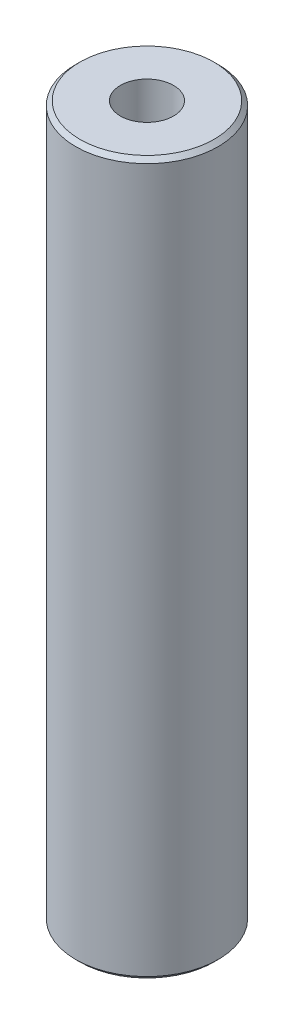
ISO-10303-21;
HEADER;
FILE_DESCRIPTION(('STEP AP214'),'2;1');
FILE_NAME('part.step','',(''),(''),'','','');
FILE_SCHEMA(('AUTOMOTIVE_DESIGN { 1 0 10303 214 1 1 1 1 }'));
ENDSEC;
DATA;
#1=APPLICATION_CONTEXT('core data for automotive mechanical design processes');
#2=APPLICATION_PROTOCOL_DEFINITION('international standard','automotive_design',2000,#1);
#3=PRODUCT_CONTEXT('',#1,'mechanical');
#4=PRODUCT('Part','Part','',(#3));
#5=PRODUCT_RELATED_PRODUCT_CATEGORY('part','',(#4));
#6=PRODUCT_DEFINITION_FORMATION('','',#4);
#7=PRODUCT_DEFINITION_CONTEXT('part definition',#1,'design');
#8=PRODUCT_DEFINITION('design','',#6,#7);
#9=PRODUCT_DEFINITION_SHAPE('','',#8);
#10=(LENGTH_UNIT() NAMED_UNIT(*) SI_UNIT(.MILLI.,.METRE.));
#11=(NAMED_UNIT(*) PLANE_ANGLE_UNIT() SI_UNIT($,.RADIAN.));
#12=(NAMED_UNIT(*) SI_UNIT($,.STERADIAN.) SOLID_ANGLE_UNIT());
#13=UNCERTAINTY_MEASURE_WITH_UNIT(LENGTH_MEASURE(1.E-05),#10,'distance_accuracy_value','');
#14=(GEOMETRIC_REPRESENTATION_CONTEXT(3) GLOBAL_UNCERTAINTY_ASSIGNED_CONTEXT((#13)) GLOBAL_UNIT_ASSIGNED_CONTEXT((#10,
#11,#12)) REPRESENTATION_CONTEXT('',''));
#15=CARTESIAN_POINT('',(0.,0.,0.));
#16=DIRECTION('',(0.,0.,1.));
#17=DIRECTION('',(1.,0.,0.));
#18=AXIS2_PLACEMENT_3D('',#15,#16,#17);
#19=CARTESIAN_POINT('',(0.,600.,0.));
#20=DIRECTION('',(0.,-1.,0.));
#21=DIRECTION('',(0.,0.,-1.));
#22=AXIS2_PLACEMENT_3D('',#19,#20,#21);
#23=CYLINDRICAL_SURFACE('',#22,60.);
#24=CARTESIAN_POINT('',(0.,596.483022775112,0.));
#25=DIRECTION('',(0.,1.,0.));
#26=DIRECTION('',(0.,0.,1.));
#27=AXIS2_PLACEMENT_3D('',#24,#25,#26);
#28=CIRCLE('',#27,60.);
#29=CARTESIAN_POINT('',(0.,596.483022775112,60.));
#30=VERTEX_POINT('',#29);
#31=EDGE_CURVE('E50',#30,#30,#28,.F.);
#32=ORIENTED_EDGE('',*,*,#31,.T.);
#33=EDGE_LOOP('',(#32));
#34=FACE_BOUND('',#33,.T.);
#35=CARTESIAN_POINT('',(0.,3.54555386866251,0.));
#36=DIRECTION('',(0.,1.,0.));
#37=DIRECTION('',(0.,0.,1.));
#38=AXIS2_PLACEMENT_3D('',#35,#36,#37);
#39=CIRCLE('',#38,60.);
#40=CARTESIAN_POINT('',(0.,3.54555386866251,60.));
#41=VERTEX_POINT('',#40);
#42=EDGE_CURVE('E51',#41,#41,#39,.T.);
#43=ORIENTED_EDGE('',*,*,#42,.T.);
#44=EDGE_LOOP('',(#43));
#45=FACE_BOUND('',#44,.T.);
#46=ADVANCED_FACE('F39',(#34,#45),#23,.T.);
#47=CARTESIAN_POINT('',(0.,600.,0.));
#48=DIRECTION('',(0.,1.,0.));
#49=DIRECTION('',(0.,0.,1.));
#50=AXIS2_PLACEMENT_3D('',#47,#48,#49);
#51=PLANE('',#50);
#52=CARTESIAN_POINT('',(0.,600.,0.));
#53=DIRECTION('',(0.,1.,0.));
#54=DIRECTION('',(0.,0.,1.));
#55=AXIS2_PLACEMENT_3D('',#52,#53,#54);
#56=CIRCLE('',#55,56.4544461313375);
#57=CARTESIAN_POINT('',(0.,600.,56.4544461313375));
#58=VERTEX_POINT('',#57);
#59=EDGE_CURVE('E54',#58,#58,#56,.T.);
#60=ORIENTED_EDGE('',*,*,#59,.T.);
#61=EDGE_LOOP('',(#60));
#62=FACE_BOUND('',#61,.T.);
#63=CARTESIAN_POINT('',(0.,600.,0.));
#64=DIRECTION('',(0.,1.,0.));
#65=DIRECTION('',(0.,0.,1.));
#66=AXIS2_PLACEMENT_3D('',#63,#64,#65);
#67=CIRCLE('',#66,22.382018282049);
#68=CARTESIAN_POINT('',(0.,600.,22.382018282049));
#69=VERTEX_POINT('',#68);
#70=EDGE_CURVE('E58',#69,#69,#67,.T.);
#71=ORIENTED_EDGE('',*,*,#70,.F.);
#72=EDGE_LOOP('',(#71));
#73=FACE_BOUND('',#72,.T.);
#74=ADVANCED_FACE('F69',(#62,#73),#51,.T.);
#75=CARTESIAN_POINT('',(0.,0.,0.));
#76=DIRECTION('',(0.,1.,0.));
#77=DIRECTION('',(0.,0.,1.));
#78=AXIS2_PLACEMENT_3D('',#75,#76,#77);
#79=PLANE('',#78);
#80=CARTESIAN_POINT('',(0.,0.,0.));
#81=DIRECTION('',(0.,1.,0.));
#82=DIRECTION('',(0.,0.,1.));
#83=AXIS2_PLACEMENT_3D('',#80,#81,#82);
#84=CIRCLE('',#83,56.4830227751121);
#85=CARTESIAN_POINT('',(0.,0.,56.4830227751121));
#86=VERTEX_POINT('',#85);
#87=EDGE_CURVE('E10',#86,#86,#84,.F.);
#88=ORIENTED_EDGE('',*,*,#87,.T.);
#89=EDGE_LOOP('',(#88));
#90=FACE_BOUND('',#89,.T.);
#91=CARTESIAN_POINT('',(0.,0.,0.));
#92=DIRECTION('',(0.,1.,0.));
#93=DIRECTION('',(0.,0.,1.));
#94=AXIS2_PLACEMENT_3D('',#91,#92,#93);
#95=CIRCLE('',#94,22.382018282049);
#96=CARTESIAN_POINT('',(0.,0.,22.382018282049));
#97=VERTEX_POINT('',#96);
#98=EDGE_CURVE('E63',#97,#97,#95,.T.);
#99=ORIENTED_EDGE('',*,*,#98,.T.);
#100=EDGE_LOOP('',(#99));
#101=FACE_BOUND('',#100,.T.);
#102=ADVANCED_FACE('F75',(#90,#101),#79,.F.);
#103=CARTESIAN_POINT('',(0.,600.,0.));
#104=DIRECTION('',(0.,-1.,0.));
#105=DIRECTION('',(0.,0.,-1.));
#106=AXIS2_PLACEMENT_3D('',#103,#104,#105);
#107=CYLINDRICAL_SURFACE('',#106,22.382018282049);
#108=ORIENTED_EDGE('',*,*,#70,.T.);
#109=EDGE_LOOP('',(#108));
#110=FACE_BOUND('',#109,.T.);
#111=ORIENTED_EDGE('',*,*,#98,.F.);
#112=EDGE_LOOP('',(#111));
#113=FACE_BOUND('',#112,.T.);
#114=ADVANCED_FACE('F70',(#110,#113),#107,.F.);
#115=CARTESIAN_POINT('',(0.,600.,0.));
#116=DIRECTION('',(0.,-1.,0.));
#117=DIRECTION('',(0.,0.,-1.));
#118=AXIS2_PLACEMENT_3D('',#115,#116,#117);
#119=CONICAL_SURFACE('',#118,56.4544461313375,0.789444373947936);
#120=ORIENTED_EDGE('',*,*,#31,.F.);
#121=EDGE_LOOP('',(#120));
#122=FACE_BOUND('',#121,.T.);
#123=ORIENTED_EDGE('',*,*,#59,.F.);
#124=EDGE_LOOP('',(#123));
#125=FACE_BOUND('',#124,.T.);
#126=ADVANCED_FACE('F81',(#122,#125),#119,.T.);
#127=CARTESIAN_POINT('',(0.,3.54555386866251,0.));
#128=DIRECTION('',(0.,1.,0.));
#129=DIRECTION('',(0.,0.,1.));
#130=AXIS2_PLACEMENT_3D('',#127,#128,#129);
#131=CONICAL_SURFACE('',#130,60.,0.781351952846961);
#132=ORIENTED_EDGE('',*,*,#87,.F.);
#133=EDGE_LOOP('',(#132));
#134=FACE_BOUND('',#133,.T.);
#135=ORIENTED_EDGE('',*,*,#42,.F.);
#136=EDGE_LOOP('',(#135));
#137=FACE_BOUND('',#136,.T.);
#138=ADVANCED_FACE('F45',(#134,#137),#131,.T.);
#139=CLOSED_SHELL('',(#46,#74,#102,#114,#126,#138));
#140=MANIFOLD_SOLID_BREP('B2',#139);
#141=ADVANCED_BREP_SHAPE_REPRESENTATION('',(#18,#140),#14);
#142=SHAPE_DEFINITION_REPRESENTATION(#9,#141);
ENDSEC;
END-ISO-10303-21;
